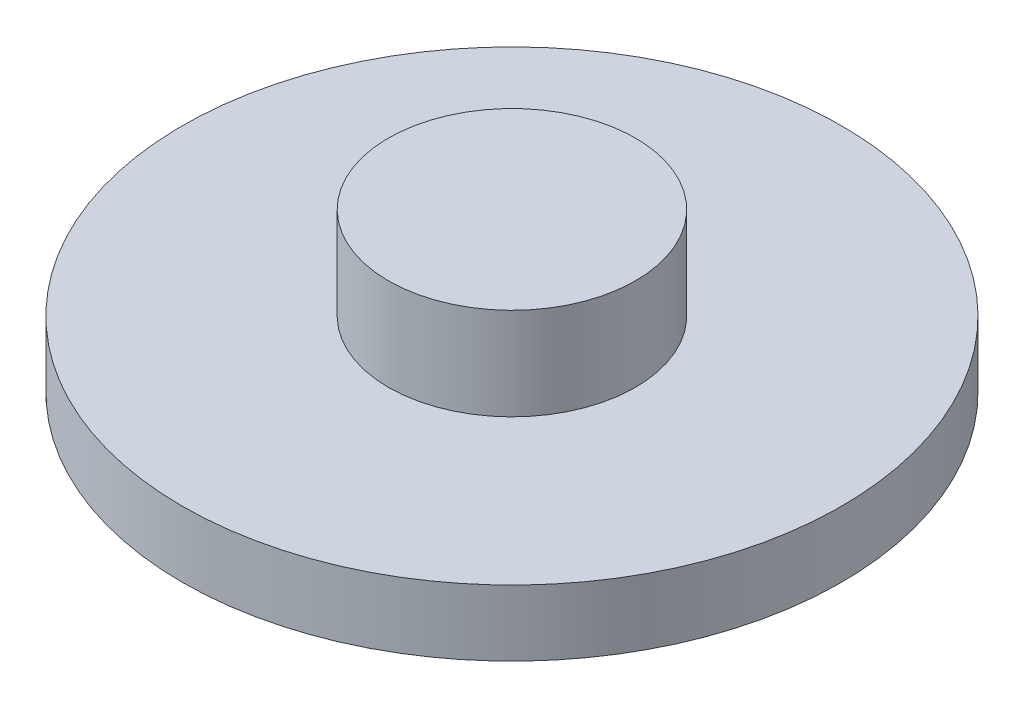
ISO-10303-21;
HEADER;
FILE_DESCRIPTION(('STEP AP214'),'2;1');
FILE_NAME('part.step','',(''),(''),'','','');
FILE_SCHEMA(('AUTOMOTIVE_DESIGN { 1 0 10303 214 1 1 1 1 }'));
ENDSEC;
DATA;
#1=APPLICATION_CONTEXT('core data for automotive mechanical design processes');
#2=APPLICATION_PROTOCOL_DEFINITION('international standard','automotive_design',2000,#1);
#3=PRODUCT_CONTEXT('',#1,'mechanical');
#4=PRODUCT('Part','Part','',(#3));
#5=PRODUCT_RELATED_PRODUCT_CATEGORY('part','',(#4));
#6=PRODUCT_DEFINITION_FORMATION('','',#4);
#7=PRODUCT_DEFINITION_CONTEXT('part definition',#1,'design');
#8=PRODUCT_DEFINITION('design','',#6,#7);
#9=PRODUCT_DEFINITION_SHAPE('','',#8);
#10=(LENGTH_UNIT() NAMED_UNIT(*) SI_UNIT(.MILLI.,.METRE.));
#11=(NAMED_UNIT(*) PLANE_ANGLE_UNIT() SI_UNIT($,.RADIAN.));
#12=(NAMED_UNIT(*) SI_UNIT($,.STERADIAN.) SOLID_ANGLE_UNIT());
#13=UNCERTAINTY_MEASURE_WITH_UNIT(LENGTH_MEASURE(1.E-05),#10,'distance_accuracy_value','');
#14=(GEOMETRIC_REPRESENTATION_CONTEXT(3) GLOBAL_UNCERTAINTY_ASSIGNED_CONTEXT((#13)) GLOBAL_UNIT_ASSIGNED_CONTEXT((#10,
#11,#12)) REPRESENTATION_CONTEXT('',''));
#15=CARTESIAN_POINT('',(0.,0.,0.));
#16=DIRECTION('',(0.,0.,1.));
#17=DIRECTION('',(1.,0.,0.));
#18=AXIS2_PLACEMENT_3D('',#15,#16,#17);
#19=CARTESIAN_POINT('',(0.,5.08,0.));
#20=DIRECTION('',(0.,-1.,0.));
#21=DIRECTION('',(0.,0.,-1.));
#22=AXIS2_PLACEMENT_3D('',#19,#20,#21);
#23=CYLINDRICAL_SURFACE('',#22,25.4);
#24=CARTESIAN_POINT('',(0.,5.08,0.));
#25=DIRECTION('',(0.,1.,0.));
#26=DIRECTION('',(0.,0.,1.));
#27=AXIS2_PLACEMENT_3D('',#24,#25,#26);
#28=CIRCLE('',#27,25.4);
#29=CARTESIAN_POINT('',(0.,5.08,25.4));
#30=VERTEX_POINT('',#29);
#31=EDGE_CURVE('E40',#30,#30,#28,.T.);
#32=ORIENTED_EDGE('',*,*,#31,.F.);
#33=EDGE_LOOP('',(#32));
#34=FACE_BOUND('',#33,.T.);
#35=CARTESIAN_POINT('',(0.,0.,0.));
#36=DIRECTION('',(0.,1.,0.));
#37=DIRECTION('',(0.,0.,1.));
#38=AXIS2_PLACEMENT_3D('',#35,#36,#37);
#39=CIRCLE('',#38,25.4);
#40=CARTESIAN_POINT('',(0.,0.,25.4));
#41=VERTEX_POINT('',#40);
#42=EDGE_CURVE('E36',#41,#41,#39,.T.);
#43=ORIENTED_EDGE('',*,*,#42,.T.);
#44=EDGE_LOOP('',(#43));
#45=FACE_BOUND('',#44,.T.);
#46=ADVANCED_FACE('F33',(#34,#45),#23,.T.);
#47=CARTESIAN_POINT('',(0.,5.08,0.));
#48=DIRECTION('',(0.,1.,0.));
#49=DIRECTION('',(0.,0.,1.));
#50=AXIS2_PLACEMENT_3D('',#47,#48,#49);
#51=PLANE('',#50);
#52=CARTESIAN_POINT('',(0.,5.08,0.));
#53=DIRECTION('',(0.,1.,0.));
#54=DIRECTION('',(0.,0.,1.));
#55=AXIS2_PLACEMENT_3D('',#52,#53,#54);
#56=CIRCLE('',#55,9.525);
#57=CARTESIAN_POINT('',(0.,5.08,9.525));
#58=VERTEX_POINT('',#57);
#59=EDGE_CURVE('E10',#58,#58,#56,.T.);
#60=ORIENTED_EDGE('',*,*,#59,.F.);
#61=EDGE_LOOP('',(#60));
#62=FACE_BOUND('',#61,.T.);
#63=ORIENTED_EDGE('',*,*,#31,.T.);
#64=EDGE_LOOP('',(#63));
#65=FACE_BOUND('',#64,.T.);
#66=ADVANCED_FACE('F57',(#62,#65),#51,.T.);
#67=CARTESIAN_POINT('',(0.,0.,0.));
#68=DIRECTION('',(0.,1.,0.));
#69=DIRECTION('',(0.,0.,1.));
#70=AXIS2_PLACEMENT_3D('',#67,#68,#69);
#71=PLANE('',#70);
#72=ORIENTED_EDGE('',*,*,#42,.F.);
#73=EDGE_LOOP('',(#72));
#74=FACE_BOUND('',#73,.T.);
#75=ADVANCED_FACE('F54',(#74),#71,.F.);
#76=CARTESIAN_POINT('',(0.,12.192,0.));
#77=DIRECTION('',(0.,-1.,0.));
#78=DIRECTION('',(0.,0.,-1.));
#79=AXIS2_PLACEMENT_3D('',#76,#77,#78);
#80=CYLINDRICAL_SURFACE('',#79,9.525);
#81=CARTESIAN_POINT('',(0.,12.192,0.));
#82=DIRECTION('',(0.,1.,0.));
#83=DIRECTION('',(0.,0.,1.));
#84=AXIS2_PLACEMENT_3D('',#81,#82,#83);
#85=CIRCLE('',#84,9.525);
#86=CARTESIAN_POINT('',(0.,12.192,9.525));
#87=VERTEX_POINT('',#86);
#88=EDGE_CURVE('E46',#87,#87,#85,.T.);
#89=ORIENTED_EDGE('',*,*,#88,.F.);
#90=EDGE_LOOP('',(#89));
#91=FACE_BOUND('',#90,.T.);
#92=ORIENTED_EDGE('',*,*,#59,.T.);
#93=EDGE_LOOP('',(#92));
#94=FACE_BOUND('',#93,.T.);
#95=ADVANCED_FACE('F56',(#91,#94),#80,.T.);
#96=CARTESIAN_POINT('',(0.,12.192,0.));
#97=DIRECTION('',(0.,1.,0.));
#98=DIRECTION('',(0.,0.,1.));
#99=AXIS2_PLACEMENT_3D('',#96,#97,#98);
#100=PLANE('',#99);
#101=ORIENTED_EDGE('',*,*,#88,.T.);
#102=EDGE_LOOP('',(#101));
#103=FACE_BOUND('',#102,.T.);
#104=ADVANCED_FACE('F62',(#103),#100,.T.);
#105=CLOSED_SHELL('',(#46,#66,#75,#95,#104));
#106=MANIFOLD_SOLID_BREP('B2',#105);
#107=ADVANCED_BREP_SHAPE_REPRESENTATION('',(#18,#106),#14);
#108=SHAPE_DEFINITION_REPRESENTATION(#9,#107);
ENDSEC;
END-ISO-10303-21;
